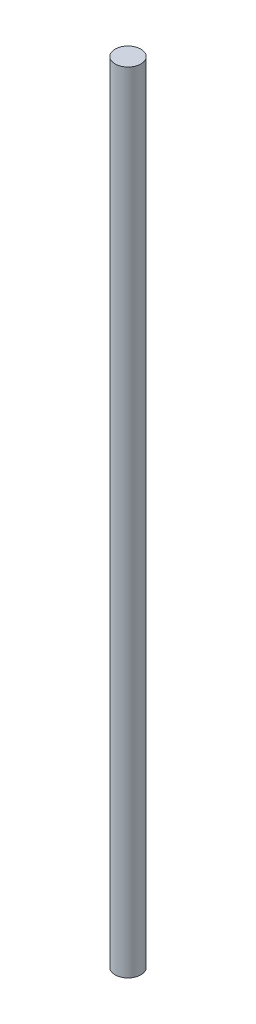
ISO-10303-21;
HEADER;
FILE_DESCRIPTION(('STEP AP214'),'2;1');
FILE_NAME('part.step','',(''),(''),'','','');
FILE_SCHEMA(('AUTOMOTIVE_DESIGN { 1 0 10303 214 1 1 1 1 }'));
ENDSEC;
DATA;
#1=APPLICATION_CONTEXT('core data for automotive mechanical design processes');
#2=APPLICATION_PROTOCOL_DEFINITION('international standard','automotive_design',2000,#1);
#3=PRODUCT_CONTEXT('',#1,'mechanical');
#4=PRODUCT('Part','Part','',(#3));
#5=PRODUCT_RELATED_PRODUCT_CATEGORY('part','',(#4));
#6=PRODUCT_DEFINITION_FORMATION('','',#4);
#7=PRODUCT_DEFINITION_CONTEXT('part definition',#1,'design');
#8=PRODUCT_DEFINITION('design','',#6,#7);
#9=PRODUCT_DEFINITION_SHAPE('','',#8);
#10=(LENGTH_UNIT() NAMED_UNIT(*) SI_UNIT(.MILLI.,.METRE.));
#11=(NAMED_UNIT(*) PLANE_ANGLE_UNIT() SI_UNIT($,.RADIAN.));
#12=(NAMED_UNIT(*) SI_UNIT($,.STERADIAN.) SOLID_ANGLE_UNIT());
#13=UNCERTAINTY_MEASURE_WITH_UNIT(LENGTH_MEASURE(1.E-05),#10,'distance_accuracy_value','');
#14=(GEOMETRIC_REPRESENTATION_CONTEXT(3) GLOBAL_UNCERTAINTY_ASSIGNED_CONTEXT((#13)) GLOBAL_UNIT_ASSIGNED_CONTEXT((#10,
#11,#12)) REPRESENTATION_CONTEXT('',''));
#15=CARTESIAN_POINT('',(0.,0.,0.));
#16=DIRECTION('',(0.,0.,1.));
#17=DIRECTION('',(1.,0.,0.));
#18=AXIS2_PLACEMENT_3D('',#15,#16,#17);
#19=CARTESIAN_POINT('',(160.,-245.,0.));
#20=DIRECTION('',(0.,1.,0.));
#21=DIRECTION('',(0.,0.,1.));
#22=AXIS2_PLACEMENT_3D('',#19,#20,#21);
#23=CYLINDRICAL_SURFACE('',#22,4.);
#24=CARTESIAN_POINT('',(160.,-245.,0.));
#25=DIRECTION('',(0.,1.,0.));
#26=DIRECTION('',(0.,0.,1.));
#27=AXIS2_PLACEMENT_3D('',#24,#25,#26);
#28=CIRCLE('',#27,4.);
#29=CARTESIAN_POINT('',(160.,-245.,4.));
#30=VERTEX_POINT('',#29);
#31=EDGE_CURVE('E10',#30,#30,#28,.T.);
#32=ORIENTED_EDGE('',*,*,#31,.T.);
#33=EDGE_LOOP('',(#32));
#34=FACE_BOUND('',#33,.T.);
#35=CARTESIAN_POINT('',(160.,0.,0.));
#36=DIRECTION('',(0.,1.,0.));
#37=DIRECTION('',(0.,0.,1.));
#38=AXIS2_PLACEMENT_3D('',#35,#36,#37);
#39=CIRCLE('',#38,4.);
#40=CARTESIAN_POINT('',(160.,0.,4.));
#41=VERTEX_POINT('',#40);
#42=EDGE_CURVE('E37',#41,#41,#39,.T.);
#43=ORIENTED_EDGE('',*,*,#42,.F.);
#44=EDGE_LOOP('',(#43));
#45=FACE_BOUND('',#44,.T.);
#46=ADVANCED_FACE('F31',(#34,#45),#23,.T.);
#47=CARTESIAN_POINT('',(164.,-245.,0.));
#48=DIRECTION('',(0.,-1.,0.));
#49=DIRECTION('',(0.,0.,-1.));
#50=AXIS2_PLACEMENT_3D('',#47,#48,#49);
#51=PLANE('',#50);
#52=ORIENTED_EDGE('',*,*,#31,.F.);
#53=EDGE_LOOP('',(#52));
#54=FACE_BOUND('',#53,.T.);
#55=ADVANCED_FACE('F46',(#54),#51,.T.);
#56=CARTESIAN_POINT('',(160.,0.,0.));
#57=DIRECTION('',(0.,1.,0.));
#58=DIRECTION('',(0.,0.,1.));
#59=AXIS2_PLACEMENT_3D('',#56,#57,#58);
#60=PLANE('',#59);
#61=ORIENTED_EDGE('',*,*,#42,.T.);
#62=EDGE_LOOP('',(#61));
#63=FACE_BOUND('',#62,.T.);
#64=ADVANCED_FACE('F43',(#63),#60,.T.);
#65=CLOSED_SHELL('',(#46,#55,#64));
#66=MANIFOLD_SOLID_BREP('B2',#65);
#67=ADVANCED_BREP_SHAPE_REPRESENTATION('',(#18,#66),#14);
#68=SHAPE_DEFINITION_REPRESENTATION(#9,#67);
ENDSEC;
END-ISO-10303-21;
